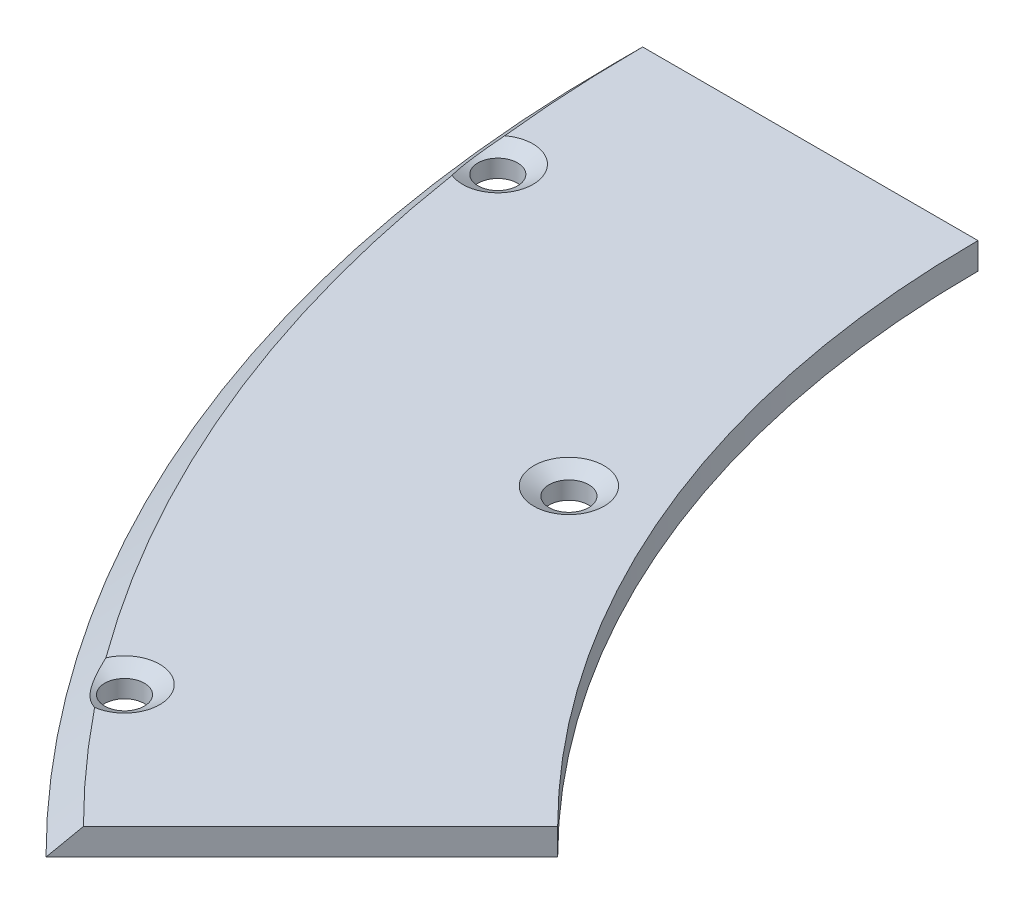
ISO-10303-21;
HEADER;
FILE_DESCRIPTION(('STEP AP214'),'2;1');
FILE_NAME('part.step','',(''),(''),'','','');
FILE_SCHEMA(('AUTOMOTIVE_DESIGN { 1 0 10303 214 1 1 1 1 }'));
ENDSEC;
DATA;
#1=APPLICATION_CONTEXT('core data for automotive mechanical design processes');
#2=APPLICATION_PROTOCOL_DEFINITION('international standard','automotive_design',2000,#1);
#3=PRODUCT_CONTEXT('',#1,'mechanical');
#4=PRODUCT('Part','Part','',(#3));
#5=PRODUCT_RELATED_PRODUCT_CATEGORY('part','',(#4));
#6=PRODUCT_DEFINITION_FORMATION('','',#4);
#7=PRODUCT_DEFINITION_CONTEXT('part definition',#1,'design');
#8=PRODUCT_DEFINITION('design','',#6,#7);
#9=PRODUCT_DEFINITION_SHAPE('','',#8);
#10=(LENGTH_UNIT() NAMED_UNIT(*) SI_UNIT(.MILLI.,.METRE.));
#11=(NAMED_UNIT(*) PLANE_ANGLE_UNIT() SI_UNIT($,.RADIAN.));
#12=(NAMED_UNIT(*) SI_UNIT($,.STERADIAN.) SOLID_ANGLE_UNIT());
#13=UNCERTAINTY_MEASURE_WITH_UNIT(LENGTH_MEASURE(1.E-05),#10,'distance_accuracy_value','');
#14=(GEOMETRIC_REPRESENTATION_CONTEXT(3) GLOBAL_UNCERTAINTY_ASSIGNED_CONTEXT((#13)) GLOBAL_UNIT_ASSIGNED_CONTEXT((#10,
#11,#12)) REPRESENTATION_CONTEXT('',''));
#15=CARTESIAN_POINT('',(0.,0.,0.));
#16=DIRECTION('',(0.,0.,1.));
#17=DIRECTION('',(1.,0.,0.));
#18=AXIS2_PLACEMENT_3D('',#15,#16,#17);
#19=CARTESIAN_POINT('',(0.,3.,0.));
#20=DIRECTION('',(0.,1.,0.));
#21=DIRECTION('',(0.,0.,1.));
#22=AXIS2_PLACEMENT_3D('',#19,#20,#21);
#23=PLANE('',#22);
#24=CARTESIAN_POINT('',(-114.099122265144,3.,47.2614038970883));
#25=DIRECTION('',(0.,1.,0.));
#26=DIRECTION('',(0.,0.,1.));
#27=AXIS2_PLACEMENT_3D('',#24,#25,#26);
#28=CIRCLE('',#27,3.9820508075689);
#29=CARTESIAN_POINT('',(-114.099122265144,3.,51.2434547046572));
#30=VERTEX_POINT('',#29);
#31=EDGE_CURVE('E11',#30,#30,#28,.F.);
#32=ORIENTED_EDGE('',*,*,#31,.T.);
#33=EDGE_LOOP('',(#32));
#34=FACE_BOUND('',#33,.T.);
#35=DIRECTION('',(-1.,0.,0.));
#36=VECTOR('',#35,1.);
#37=CARTESIAN_POINT('',(-115.,3.,0.));
#38=LINE('',#37,#36);
#39=CARTESIAN_POINT('',(-115.,3.,0.));
#40=VERTEX_POINT('',#39);
#41=CARTESIAN_POINT('',(-153.,3.,0.));
#42=VERTEX_POINT('',#41);
#43=EDGE_CURVE('E84',#40,#42,#38,.T.);
#44=ORIENTED_EDGE('',*,*,#43,.T.);
#45=CARTESIAN_POINT('',(0.,3.,0.));
#46=DIRECTION('',(0.,1.,0.));
#47=DIRECTION('',(0.,0.,1.));
#48=AXIS2_PLACEMENT_3D('',#45,#46,#47);
#49=CIRCLE('',#48,153.);
#50=CARTESIAN_POINT('',(-152.10452532569,3.,16.5291674154085));
#51=VERTEX_POINT('',#50);
#52=EDGE_CURVE('E123',#42,#51,#49,.T.);
#53=ORIENTED_EDGE('',*,*,#52,.T.);
#54=CARTESIAN_POINT('',(-149.708174067445,3.,19.7094550252278));
#55=DIRECTION('',(0.,1.,0.));
#56=DIRECTION('',(0.,0.,1.));
#57=AXIS2_PLACEMENT_3D('',#54,#55,#56);
#58=CIRCLE('',#57,3.98205080756889);
#59=CARTESIAN_POINT('',(-151.199752634319,3.,23.4015983069685));
#60=VERTEX_POINT('',#59);
#61=EDGE_CURVE('E108',#51,#60,#58,.F.);
#62=ORIENTED_EDGE('',*,*,#61,.T.);
#63=CARTESIAN_POINT('',(0.,3.,0.));
#64=DIRECTION('',(0.,1.,0.));
#65=DIRECTION('',(0.,0.,1.));
#66=AXIS2_PLACEMENT_3D('',#63,#64,#65);
#67=CIRCLE('',#66,153.);
#68=CARTESIAN_POINT('',(-123.461799254917,3.,90.3669415479939));
#69=VERTEX_POINT('',#68);
#70=EDGE_CURVE('E121',#60,#69,#67,.T.);
#71=ORIENTED_EDGE('',*,*,#70,.T.);
#72=CARTESIAN_POINT('',(-119.796354383977,3.,91.9229757803162));
#73=DIRECTION('',(0.,1.,0.));
#74=DIRECTION('',(0.,0.,1.));
#75=AXIS2_PLACEMENT_3D('',#72,#73,#74);
#76=CIRCLE('',#75,3.98205080756889);
#77=CARTESIAN_POINT('',(-119.24202767376,3.,95.8662549401525));
#78=VERTEX_POINT('',#77);
#79=EDGE_CURVE('E115',#69,#78,#76,.F.);
#80=ORIENTED_EDGE('',*,*,#79,.T.);
#81=CARTESIAN_POINT('',(0.,3.,0.));
#82=DIRECTION('',(0.,1.,0.));
#83=DIRECTION('',(0.,0.,1.));
#84=AXIS2_PLACEMENT_3D('',#81,#82,#83);
#85=CIRCLE('',#84,153.);
#86=CARTESIAN_POINT('',(-108.187337521542,3.00000000000002,108.187337521541));
#87=VERTEX_POINT('',#86);
#88=EDGE_CURVE('E47',#78,#87,#85,.T.);
#89=ORIENTED_EDGE('',*,*,#88,.T.);
#90=DIRECTION('',(0.707106781186551,0.,-0.707106781186544));
#91=VECTOR('',#90,1.);
#92=CARTESIAN_POINT('',(-110.308657865102,3.,110.308657865101));
#93=LINE('',#92,#91);
#94=CARTESIAN_POINT('',(-81.3172798364534,3.,81.3172798364525));
#95=VERTEX_POINT('',#94);
#96=EDGE_CURVE('E92',#87,#95,#93,.T.);
#97=ORIENTED_EDGE('',*,*,#96,.T.);
#98=CARTESIAN_POINT('',(0.,3.,0.));
#99=DIRECTION('',(0.,-1.,0.));
#100=DIRECTION('',(0.,0.,1.));
#101=AXIS2_PLACEMENT_3D('',#98,#99,#100);
#102=CIRCLE('',#101,115.);
#103=EDGE_CURVE('E93',#95,#40,#102,.T.);
#104=ORIENTED_EDGE('',*,*,#103,.T.);
#105=EDGE_LOOP('',(#44,#53,#62,#71,#80,#89,#97,#104));
#106=FACE_BOUND('',#105,.T.);
#107=ADVANCED_FACE('F32',(#34,#106),#23,.T.);
#108=CARTESIAN_POINT('',(0.,0.,0.));
#109=DIRECTION('',(0.,1.,0.));
#110=DIRECTION('',(0.,0.,1.));
#111=AXIS2_PLACEMENT_3D('',#108,#109,#110);
#112=PLANE('',#111);
#113=CARTESIAN_POINT('',(-114.099122265144,0.,47.2614038970883));
#114=DIRECTION('',(0.,1.,0.));
#115=DIRECTION('',(0.,0.,1.));
#116=AXIS2_PLACEMENT_3D('',#113,#114,#115);
#117=CIRCLE('',#116,2.25000000000001);
#118=CARTESIAN_POINT('',(-114.099122265144,0.,49.5114038970883));
#119=VERTEX_POINT('',#118);
#120=EDGE_CURVE('E193',#119,#119,#117,.T.);
#121=ORIENTED_EDGE('',*,*,#120,.T.);
#122=EDGE_LOOP('',(#121));
#123=FACE_BOUND('',#122,.T.);
#124=CARTESIAN_POINT('',(-149.708174067445,0.,19.7094550252278));
#125=DIRECTION('',(0.,1.,0.));
#126=DIRECTION('',(0.,0.,1.));
#127=AXIS2_PLACEMENT_3D('',#124,#125,#126);
#128=CIRCLE('',#127,2.25000000000001);
#129=CARTESIAN_POINT('',(-149.708174067445,0.,21.9594550252278));
#130=VERTEX_POINT('',#129);
#131=EDGE_CURVE('E192',#130,#130,#128,.T.);
#132=ORIENTED_EDGE('',*,*,#131,.T.);
#133=EDGE_LOOP('',(#132));
#134=FACE_BOUND('',#133,.T.);
#135=CARTESIAN_POINT('',(0.,0.,0.));
#136=DIRECTION('',(0.,-1.,0.));
#137=DIRECTION('',(0.,0.,1.));
#138=AXIS2_PLACEMENT_3D('',#135,#136,#137);
#139=CIRCLE('',#138,115.);
#140=CARTESIAN_POINT('',(-81.3172798364534,0.,81.3172798364525));
#141=VERTEX_POINT('',#140);
#142=CARTESIAN_POINT('',(-115.,0.,0.));
#143=VERTEX_POINT('',#142);
#144=EDGE_CURVE('E103',#141,#143,#139,.T.);
#145=ORIENTED_EDGE('',*,*,#144,.F.);
#146=DIRECTION('',(0.707106781186551,0.,-0.707106781186544));
#147=VECTOR('',#146,1.);
#148=CARTESIAN_POINT('',(-110.308657865102,0.,110.308657865101));
#149=LINE('',#148,#147);
#150=CARTESIAN_POINT('',(-110.308657865102,0.,110.308657865101));
#151=VERTEX_POINT('',#150);
#152=EDGE_CURVE('E99',#151,#141,#149,.T.);
#153=ORIENTED_EDGE('',*,*,#152,.F.);
#154=CARTESIAN_POINT('',(0.,0.,0.));
#155=DIRECTION('',(0.,1.,0.));
#156=DIRECTION('',(0.,0.,1.));
#157=AXIS2_PLACEMENT_3D('',#154,#155,#156);
#158=CIRCLE('',#157,156.);
#159=CARTESIAN_POINT('',(-156.,0.,0.));
#160=VERTEX_POINT('',#159);
#161=EDGE_CURVE('E204',#160,#151,#158,.T.);
#162=ORIENTED_EDGE('',*,*,#161,.F.);
#163=DIRECTION('',(-1.,0.,0.));
#164=VECTOR('',#163,1.);
#165=CARTESIAN_POINT('',(-115.,0.,0.));
#166=LINE('',#165,#164);
#167=EDGE_CURVE('E202',#143,#160,#166,.T.);
#168=ORIENTED_EDGE('',*,*,#167,.F.);
#169=EDGE_LOOP('',(#145,#153,#162,#168));
#170=FACE_BOUND('',#169,.T.);
#171=CARTESIAN_POINT('',(-119.796354383977,0.,91.9229757803162));
#172=DIRECTION('',(0.,1.,0.));
#173=DIRECTION('',(0.,0.,1.));
#174=AXIS2_PLACEMENT_3D('',#171,#172,#173);
#175=CIRCLE('',#174,2.25);
#176=CARTESIAN_POINT('',(-119.796354383977,0.,94.1729757803162));
#177=VERTEX_POINT('',#176);
#178=EDGE_CURVE('E190',#177,#177,#175,.T.);
#179=ORIENTED_EDGE('',*,*,#178,.T.);
#180=EDGE_LOOP('',(#179));
#181=FACE_BOUND('',#180,.T.);
#182=ADVANCED_FACE('F153',(#123,#134,#170,#181),#112,.F.);
#183=CARTESIAN_POINT('',(0.,3.,0.));
#184=DIRECTION('',(0.,-1.,0.));
#185=DIRECTION('',(0.,0.,-1.));
#186=AXIS2_PLACEMENT_3D('',#183,#184,#185);
#187=CYLINDRICAL_SURFACE('',#186,115.);
#188=ORIENTED_EDGE('',*,*,#144,.T.);
#189=DIRECTION('',(0.,-1.,0.));
#190=VECTOR('',#189,1.);
#191=CARTESIAN_POINT('',(-115.,3.,0.));
#192=LINE('',#191,#190);
#193=EDGE_CURVE('E88',#40,#143,#192,.T.);
#194=ORIENTED_EDGE('',*,*,#193,.F.);
#195=ORIENTED_EDGE('',*,*,#103,.F.);
#196=DIRECTION('',(0.,-1.,0.));
#197=VECTOR('',#196,1.);
#198=CARTESIAN_POINT('',(-81.3172798364534,3.,81.3172798364525));
#199=LINE('',#198,#197);
#200=EDGE_CURVE('E105',#95,#141,#199,.T.);
#201=ORIENTED_EDGE('',*,*,#200,.T.);
#202=EDGE_LOOP('',(#188,#194,#195,#201));
#203=FACE_BOUND('',#202,.T.);
#204=ADVANCED_FACE('F101',(#203),#187,.F.);
#205=CARTESIAN_POINT('',(-115.,3.,0.));
#206=DIRECTION('',(0.,0.,1.));
#207=DIRECTION('',(1.,0.,0.));
#208=AXIS2_PLACEMENT_3D('',#205,#206,#207);
#209=PLANE('',#208);
#210=ORIENTED_EDGE('',*,*,#167,.T.);
#211=DIRECTION('',(-0.707106781186544,-0.707106781186551,0.));
#212=VECTOR('',#211,1.);
#213=CARTESIAN_POINT('',(0.,156.000000000001,0.));
#214=LINE('',#213,#212);
#215=EDGE_CURVE('E55',#160,#42,#214,.F.);
#216=ORIENTED_EDGE('',*,*,#215,.T.);
#217=ORIENTED_EDGE('',*,*,#43,.F.);
#218=ORIENTED_EDGE('',*,*,#193,.T.);
#219=EDGE_LOOP('',(#210,#216,#217,#218));
#220=FACE_BOUND('',#219,.T.);
#221=ADVANCED_FACE('F86',(#220),#209,.F.);
#222=CARTESIAN_POINT('',(-110.308657865102,3.,110.308657865101));
#223=DIRECTION('',(-0.707106781186544,0.,-0.707106781186551));
#224=DIRECTION('',(-0.707106781186551,0.,0.707106781186544));
#225=AXIS2_PLACEMENT_3D('',#222,#223,#224);
#226=PLANE('',#225);
#227=ORIENTED_EDGE('',*,*,#96,.F.);
#228=DIRECTION('',(0.5,0.707106781186551,-0.499999999999995));
#229=VECTOR('',#228,1.);
#230=CARTESIAN_POINT('',(0.,156.000000000001,0.));
#231=LINE('',#230,#229);
#232=EDGE_CURVE('E208',#87,#151,#231,.F.);
#233=ORIENTED_EDGE('',*,*,#232,.T.);
#234=ORIENTED_EDGE('',*,*,#152,.T.);
#235=ORIENTED_EDGE('',*,*,#200,.F.);
#236=EDGE_LOOP('',(#227,#233,#234,#235));
#237=FACE_BOUND('',#236,.T.);
#238=ADVANCED_FACE('F165',(#237),#226,.F.);
#239=CARTESIAN_POINT('',(-149.708174067445,3.,19.7094550252278));
#240=DIRECTION('',(0.,-1.,0.));
#241=DIRECTION('',(0.,0.,-1.));
#242=AXIS2_PLACEMENT_3D('',#239,#240,#241);
#243=CYLINDRICAL_SURFACE('',#242,2.25000000000001);
#244=CARTESIAN_POINT('',(-149.708174067445,1.99999999999999,19.7094550252278));
#245=DIRECTION('',(0.,1.,0.));
#246=DIRECTION('',(0.,0.,1.));
#247=AXIS2_PLACEMENT_3D('',#244,#245,#246);
#248=CIRCLE('',#247,2.25000000000001);
#249=CARTESIAN_POINT('',(-149.708174067445,1.99999999999999,21.9594550252278));
#250=VERTEX_POINT('',#249);
#251=EDGE_CURVE('E117',#250,#250,#248,.T.);
#252=ORIENTED_EDGE('',*,*,#251,.T.);
#253=EDGE_LOOP('',(#252));
#254=FACE_BOUND('',#253,.T.);
#255=ORIENTED_EDGE('',*,*,#131,.F.);
#256=EDGE_LOOP('',(#255));
#257=FACE_BOUND('',#256,.T.);
#258=ADVANCED_FACE('F162',(#254,#257),#243,.F.);
#259=CARTESIAN_POINT('',(-119.796354383977,3.,91.9229757803162));
#260=DIRECTION('',(0.,-1.,0.));
#261=DIRECTION('',(0.,0.,-1.));
#262=AXIS2_PLACEMENT_3D('',#259,#260,#261);
#263=CYLINDRICAL_SURFACE('',#262,2.25);
#264=CARTESIAN_POINT('',(-119.796354383977,1.99999999999998,91.9229757803162));
#265=DIRECTION('',(0.,1.,0.));
#266=DIRECTION('',(0.,0.,1.));
#267=AXIS2_PLACEMENT_3D('',#264,#265,#266);
#268=CIRCLE('',#267,2.25);
#269=CARTESIAN_POINT('',(-119.796354383977,1.99999999999998,94.1729757803162));
#270=VERTEX_POINT('',#269);
#271=EDGE_CURVE('E104',#270,#270,#268,.T.);
#272=ORIENTED_EDGE('',*,*,#271,.T.);
#273=EDGE_LOOP('',(#272));
#274=FACE_BOUND('',#273,.T.);
#275=ORIENTED_EDGE('',*,*,#178,.F.);
#276=EDGE_LOOP('',(#275));
#277=FACE_BOUND('',#276,.T.);
#278=ADVANCED_FACE('F175',(#274,#277),#263,.F.);
#279=CARTESIAN_POINT('',(-119.796354383977,1.99999999999998,91.9229757803162));
#280=DIRECTION('',(0.,1.,0.));
#281=DIRECTION('',(0.,0.,1.));
#282=AXIS2_PLACEMENT_3D('',#279,#280,#281);
#283=CONICAL_SURFACE('',#282,2.25,1.04719755119659);
#284=ORIENTED_EDGE('',*,*,#79,.F.);
#285=CARTESIAN_POINT('',(-123.461799254917,3.,90.3669415479939));
#286=CARTESIAN_POINT('',(-123.43086619996,2.95799230259586,90.4803258383819));
#287=CARTESIAN_POINT('',(-123.398475590095,2.91703727255009,90.5937200034644));
#288=CARTESIAN_POINT('',(-123.330378336554,2.83759267972244,90.8204451428695));
#289=CARTESIAN_POINT('',(-123.294669961324,2.79910442226574,90.9337760527869));
#290=CARTESIAN_POINT('',(-123.219315966755,2.7247497940451,91.160931933753));
#291=CARTESIAN_POINT('',(-123.179645537626,2.68890274778597,91.27475511774));
#292=CARTESIAN_POINT('',(-123.0961652689,2.62059204780658,91.5018598911807));
#293=CARTESIAN_POINT('',(-123.052356031556,2.58812790326824,91.6151415569203));
#294=CARTESIAN_POINT('',(-122.915354593616,2.4974489120459,91.9505457026514));
#295=CARTESIAN_POINT('',(-122.815492862829,2.44481376842435,92.1716201934287));
#296=CARTESIAN_POINT('',(-122.650347935653,2.38048229355576,92.4979067433283));
#297=CARTESIAN_POINT('',(-122.592815599228,2.36148876983367,92.6056609376342));
#298=CARTESIAN_POINT('',(-122.472396470722,2.32882183957727,92.8189518473314));
#299=CARTESIAN_POINT('',(-122.409510797251,2.31514732491506,92.9244890202638));
#300=CARTESIAN_POINT('',(-122.258309230117,2.29024095731079,93.1644857721));
#301=CARTESIAN_POINT('',(-122.168081534219,2.28102157288939,93.2979642511846));
#302=CARTESIAN_POINT('',(-121.978702147758,2.27287019398707,93.5588191029214));
#303=CARTESIAN_POINT('',(-121.879548020027,2.27394101751394,93.6861937944328));
#304=CARTESIAN_POINT('',(-121.673144789091,2.28631761644576,93.9338488360516));
#305=CARTESIAN_POINT('',(-121.565888957656,2.2976319864059,94.0541231384998));
#306=CARTESIAN_POINT('',(-121.344636221354,2.32987678191294,94.2868578593325));
#307=CARTESIAN_POINT('',(-121.230639938235,2.35080632174493,94.3993189963394));
#308=CARTESIAN_POINT('',(-120.969225238508,2.40732778672588,94.6424512265605));
#309=CARTESIAN_POINT('',(-120.820351906745,2.44523318858431,94.7710145933979));
#310=CARTESIAN_POINT('',(-120.516516131815,2.53204544462214,95.0169396106473));
#311=CARTESIAN_POINT('',(-120.361546886333,2.58096489411536,95.1342882156195));
#312=CARTESIAN_POINT('',(-120.047149647202,2.68771282172956,95.3591833297421));
#313=CARTESIAN_POINT('',(-119.887713007253,2.74555971617013,95.4667088279377));
#314=CARTESIAN_POINT('',(-119.646684890622,2.83746967481599,95.6213345973857));
#315=CARTESIAN_POINT('',(-119.56614860375,2.86891343056184,95.6716976042384));
#316=CARTESIAN_POINT('',(-119.40449955394,2.93334376170601,95.7704268606982));
#317=CARTESIAN_POINT('',(-119.323386933139,2.96632996718199,95.818793583884));
#318=CARTESIAN_POINT('',(-119.24202767376,3.00000000000001,95.8662549401525));
#319=B_SPLINE_CURVE_WITH_KNOTS('',3,(#285,#286,#287,#288,#289,#290,#291,#292,#293,#294,#295,
#296,#297,#298,#299,#300,#301,#302,#303,#304,#305,#306,#307,#308,#309,#310,#311,#312,#313,#314,
#315,#316,#317,#318),.UNSPECIFIED.,.F.,.F.,(4,2,2,2,2,2,2,2,2,2,2,2,2,2,2,2,4),(0.,
0.374438735025378,0.74907400062623,1.1262229191616,1.50331704154201,2.24631772566529,
2.61696943822891,2.98754389020266,3.47098487763635,3.95455826076947,4.43853774872642,
4.92247266316829,5.52255675110642,6.12333059340512,6.72536075252574,7.02550311873682,
7.32557386799686),.UNSPECIFIED.);
#320=EDGE_CURVE('E131',#69,#78,#319,.T.);
#321=ORIENTED_EDGE('',*,*,#320,.T.);
#322=EDGE_LOOP('',(#284,#321));
#323=FACE_BOUND('',#322,.T.);
#324=ORIENTED_EDGE('',*,*,#271,.F.);
#325=EDGE_LOOP('',(#324));
#326=FACE_BOUND('',#325,.T.);
#327=ADVANCED_FACE('F172',(#323,#326),#283,.F.);
#328=CARTESIAN_POINT('',(-149.708174067445,1.99999999999999,19.7094550252278));
#329=DIRECTION('',(0.,1.,0.));
#330=DIRECTION('',(0.,0.,1.));
#331=AXIS2_PLACEMENT_3D('',#328,#329,#330);
#332=CONICAL_SURFACE('',#331,2.25000000000001,1.04719755119659);
#333=ORIENTED_EDGE('',*,*,#61,.F.);
#334=CARTESIAN_POINT('',(-152.10452532569,3.,16.5291674154085));
#335=CARTESIAN_POINT('',(-152.134428659474,2.95799230259587,16.642827618753));
#336=CARTESIAN_POINT('',(-152.163074651029,2.9170372725501,16.7572251512879));
#337=CARTESIAN_POINT('',(-152.217463269237,2.83759267972244,16.9876235084599));
#338=CARTESIAN_POINT('',(-152.243204364118,2.79910442226575,17.1036251430974));
#339=CARTESIAN_POINT('',(-152.291523831027,2.7247497940451,17.3380249039178));
#340=CARTESIAN_POINT('',(-152.314079823617,2.68890274778597,17.4564338873543));
#341=CARTESIAN_POINT('',(-152.355336176905,2.62059204780659,17.694852524838));
#342=CARTESIAN_POINT('',(-152.374037097314,2.58812790326825,17.8148619438234));
#343=CARTESIAN_POINT('',(-152.42309244457,2.49744891204591,18.1738311735309));
#344=CARTESIAN_POINT('',(-152.44714689423,2.44481376842435,18.4152181640665));
#345=CARTESIAN_POINT('',(-152.467270466939,2.38048229355576,18.7803630687808));
#346=CARTESIAN_POINT('',(-152.471323099209,2.36148876983367,18.9024471066265));
#347=CARTESIAN_POINT('',(-152.47368252967,2.32882183957728,19.1473720170734));
#348=CARTESIAN_POINT('',(-152.471990525377,2.31514732491507,19.2702127266117));
#349=CARTESIAN_POINT('',(-152.461044503065,2.2902409573108,19.553656794095));
#350=CARTESIAN_POINT('',(-152.449644265834,2.2810215728894,19.7143663957898));
#351=CARTESIAN_POINT('',(-152.416064332075,2.27287019398708,20.0349630173245));
#352=CARTESIAN_POINT('',(-152.393881684325,2.27394101751394,20.194849799838));
#353=CARTESIAN_POINT('',(-152.33895876372,2.28631761644576,20.5125269727236));
#354=CARTESIAN_POINT('',(-152.306209640218,2.29763198640591,20.6703154897836));
#355=CARTESIAN_POINT('',(-152.23096651034,2.32987678191295,20.9824960385184));
#356=CARTESIAN_POINT('',(-152.188473401726,2.35080632174494,21.136888381664));
#357=CARTESIAN_POINT('',(-152.083647745949,2.40732778672588,21.4781544193782));
#358=CARTESIAN_POINT('',(-152.019001342116,2.4452331885843,21.6639302269364));
#359=CARTESIAN_POINT('',(-151.878834351073,2.53204544462213,22.0288254267656));
#360=CARTESIAN_POINT('',(-151.803301350166,2.58096489411536,22.2079369225115));
#361=CARTESIAN_POINT('',(-151.64347291126,2.68771282172957,22.5599004240943));
#362=CARTESIAN_POINT('',(-151.559159479868,2.74555971617012,22.7327385570603));
#363=CARTESIAN_POINT('',(-151.427735892563,2.83746967481598,22.9871624597977));
#364=CARTESIAN_POINT('',(-151.383170925632,2.86891343056183,23.0710462465791));
#365=CARTESIAN_POINT('',(-151.292543370228,2.933343761706,23.2373728156753));
#366=CARTESIAN_POINT('',(-151.246481141641,2.96632996718198,23.3198159370521));
#367=CARTESIAN_POINT('',(-151.199752634319,2.99999999999999,23.4015983069685));
#368=B_SPLINE_CURVE_WITH_KNOTS('',3,(#334,#335,#336,#337,#338,#339,#340,#341,#342,#343,#344,
#345,#346,#347,#348,#349,#350,#351,#352,#353,#354,#355,#356,#357,#358,#359,#360,#361,#362,#363,
#364,#365,#366,#367),.UNSPECIFIED.,.F.,.F.,(4,2,2,2,2,2,2,2,2,2,2,2,2,2,2,2,4),(0.,
0.374438735025374,0.749074000626217,1.12622291916156,1.50331704154197,2.24631772566528,
2.61696943822888,2.98754389020262,3.47098487763631,3.95455826076944,4.43853774872638,
4.92247266316825,5.52255675110634,6.12333059340507,6.7253607525257,7.02550311873677,
7.32557386799681),.UNSPECIFIED.);
#369=EDGE_CURVE('E125',#51,#60,#368,.T.);
#370=ORIENTED_EDGE('',*,*,#369,.T.);
#371=EDGE_LOOP('',(#333,#370));
#372=FACE_BOUND('',#371,.T.);
#373=ORIENTED_EDGE('',*,*,#251,.F.);
#374=EDGE_LOOP('',(#373));
#375=FACE_BOUND('',#374,.T.);
#376=ADVANCED_FACE('F137',(#372,#375),#332,.F.);
#377=CARTESIAN_POINT('',(-114.099122265144,0.,47.2614038970883));
#378=DIRECTION('',(0.,1.,0.));
#379=DIRECTION('',(0.,0.,1.));
#380=AXIS2_PLACEMENT_3D('',#377,#378,#379);
#381=CYLINDRICAL_SURFACE('',#380,2.25000000000001);
#382=CARTESIAN_POINT('',(-114.099122265144,1.99999999999998,47.2614038970883));
#383=DIRECTION('',(0.,1.,0.));
#384=DIRECTION('',(0.,0.,1.));
#385=AXIS2_PLACEMENT_3D('',#382,#383,#384);
#386=CIRCLE('',#385,2.25000000000001);
#387=CARTESIAN_POINT('',(-114.099122265144,1.99999999999998,49.5114038970883));
#388=VERTEX_POINT('',#387);
#389=EDGE_CURVE('E40',#388,#388,#386,.T.);
#390=ORIENTED_EDGE('',*,*,#389,.T.);
#391=EDGE_LOOP('',(#390));
#392=FACE_BOUND('',#391,.T.);
#393=ORIENTED_EDGE('',*,*,#120,.F.);
#394=EDGE_LOOP('',(#393));
#395=FACE_BOUND('',#394,.T.);
#396=ADVANCED_FACE('F142',(#392,#395),#381,.F.);
#397=CARTESIAN_POINT('',(0.,3.,0.));
#398=DIRECTION('',(0.,-1.,0.));
#399=DIRECTION('',(0.,0.,-1.));
#400=AXIS2_PLACEMENT_3D('',#397,#398,#399);
#401=CONICAL_SURFACE('',#400,153.,0.785398163397444);
#402=ORIENTED_EDGE('',*,*,#215,.F.);
#403=ORIENTED_EDGE('',*,*,#161,.T.);
#404=ORIENTED_EDGE('',*,*,#232,.F.);
#405=ORIENTED_EDGE('',*,*,#88,.F.);
#406=ORIENTED_EDGE('',*,*,#320,.F.);
#407=ORIENTED_EDGE('',*,*,#70,.F.);
#408=ORIENTED_EDGE('',*,*,#369,.F.);
#409=ORIENTED_EDGE('',*,*,#52,.F.);
#410=EDGE_LOOP('',(#402,#403,#404,#405,#406,#407,#408,#409));
#411=FACE_BOUND('',#410,.T.);
#412=ADVANCED_FACE('F139',(#411),#401,.T.);
#413=CARTESIAN_POINT('',(-114.099122265144,1.99999999999998,47.2614038970883));
#414=DIRECTION('',(0.,1.,0.));
#415=DIRECTION('',(0.,0.,1.));
#416=AXIS2_PLACEMENT_3D('',#413,#414,#415);
#417=CONICAL_SURFACE('',#416,2.25000000000001,1.04719755119659);
#418=ORIENTED_EDGE('',*,*,#31,.F.);
#419=EDGE_LOOP('',(#418));
#420=FACE_BOUND('',#419,.T.);
#421=ORIENTED_EDGE('',*,*,#389,.F.);
#422=EDGE_LOOP('',(#421));
#423=FACE_BOUND('',#422,.T.);
#424=ADVANCED_FACE('F34',(#420,#423),#417,.F.);
#425=CLOSED_SHELL('',(#107,#182,#204,#221,#238,#258,#278,#327,#376,#396,#412,#424));
#426=MANIFOLD_SOLID_BREP('B2',#425);
#427=ADVANCED_BREP_SHAPE_REPRESENTATION('',(#18,#426),#14);
#428=SHAPE_DEFINITION_REPRESENTATION(#9,#427);
ENDSEC;
END-ISO-10303-21;
